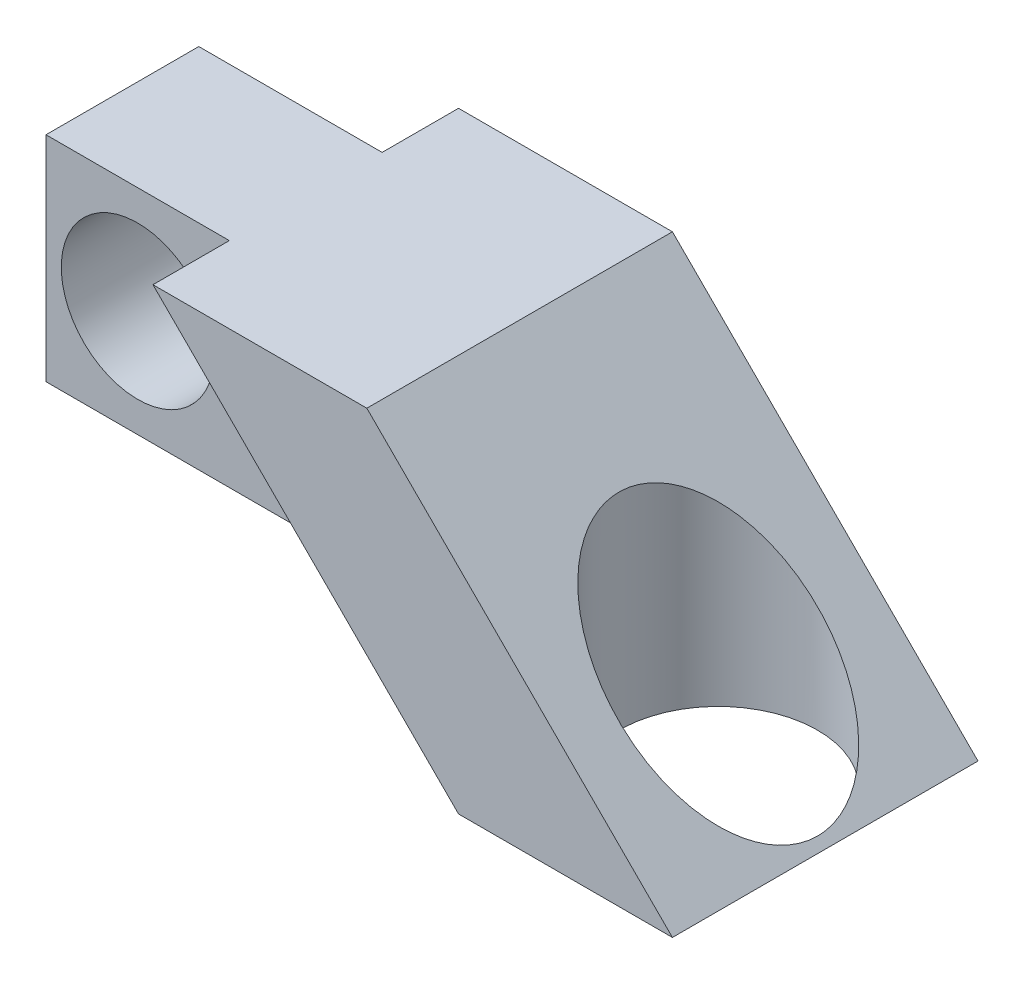
ISO-10303-21;
HEADER;
FILE_DESCRIPTION(('STEP AP214'),'2;1');
FILE_NAME('part.step','',(''),(''),'','','');
FILE_SCHEMA(('AUTOMOTIVE_DESIGN { 1 0 10303 214 1 1 1 1 }'));
ENDSEC;
DATA;
#1=APPLICATION_CONTEXT('core data for automotive mechanical design processes');
#2=APPLICATION_PROTOCOL_DEFINITION('international standard','automotive_design',2000,#1);
#3=PRODUCT_CONTEXT('',#1,'mechanical');
#4=PRODUCT('Part','Part','',(#3));
#5=PRODUCT_RELATED_PRODUCT_CATEGORY('part','',(#4));
#6=PRODUCT_DEFINITION_FORMATION('','',#4);
#7=PRODUCT_DEFINITION_CONTEXT('part definition',#1,'design');
#8=PRODUCT_DEFINITION('design','',#6,#7);
#9=PRODUCT_DEFINITION_SHAPE('','',#8);
#10=(LENGTH_UNIT() NAMED_UNIT(*) SI_UNIT(.MILLI.,.METRE.));
#11=(NAMED_UNIT(*) PLANE_ANGLE_UNIT() SI_UNIT($,.RADIAN.));
#12=(NAMED_UNIT(*) SI_UNIT($,.STERADIAN.) SOLID_ANGLE_UNIT());
#13=UNCERTAINTY_MEASURE_WITH_UNIT(LENGTH_MEASURE(1.E-05),#10,'distance_accuracy_value','');
#14=(GEOMETRIC_REPRESENTATION_CONTEXT(3) GLOBAL_UNCERTAINTY_ASSIGNED_CONTEXT((#13)) GLOBAL_UNIT_ASSIGNED_CONTEXT((#10,
#11,#12)) REPRESENTATION_CONTEXT('',''));
#15=CARTESIAN_POINT('',(0.,0.,0.));
#16=DIRECTION('',(0.,0.,1.));
#17=DIRECTION('',(1.,0.,0.));
#18=AXIS2_PLACEMENT_3D('',#15,#16,#17);
#19=CARTESIAN_POINT('',(0.,0.,5.));
#20=DIRECTION('',(-0.707106781186547,-0.707106781186548,0.));
#21=DIRECTION('',(0.707106781186548,-0.707106781186547,0.));
#22=AXIS2_PLACEMENT_3D('',#19,#20,#21);
#23=PLANE('',#22);
#24=CARTESIAN_POINT('',(-3.5,3.5,0.));
#25=DIRECTION('',(-0.707106781186547,-0.707106781186548,0.));
#26=DIRECTION('',(0.707106781186548,-0.707106781186547,0.));
#27=AXIS2_PLACEMENT_3D('',#24,#25,#26);
#28=ELLIPSE('',#27,4.59619407771256,3.25);
#29=CARTESIAN_POINT('',(-0.25,0.249999999999999,0.));
#30=VERTEX_POINT('',#29);
#31=EDGE_CURVE('E131',#30,#30,#28,.T.);
#32=ORIENTED_EDGE('',*,*,#31,.T.);
#33=EDGE_LOOP('',(#32));
#34=FACE_BOUND('',#33,.T.);
#35=DIRECTION('',(-0.707106781186548,0.707106781186547,0.));
#36=VECTOR('',#35,1.);
#37=CARTESIAN_POINT('',(0.,0.,-5.));
#38=LINE('',#37,#36);
#39=CARTESIAN_POINT('',(0.,0.,-5.));
#40=VERTEX_POINT('',#39);
#41=CARTESIAN_POINT('',(-10.,10.,-5.));
#42=VERTEX_POINT('',#41);
#43=EDGE_CURVE('E134',#40,#42,#38,.T.);
#44=ORIENTED_EDGE('',*,*,#43,.T.);
#45=DIRECTION('',(0.,0.,-1.));
#46=VECTOR('',#45,1.);
#47=CARTESIAN_POINT('',(-10.,10.,5.));
#48=LINE('',#47,#46);
#49=CARTESIAN_POINT('',(-10.,10.,5.));
#50=VERTEX_POINT('',#49);
#51=EDGE_CURVE('E162',#50,#42,#48,.T.);
#52=ORIENTED_EDGE('',*,*,#51,.F.);
#53=DIRECTION('',(-0.707106781186548,0.707106781186547,0.));
#54=VECTOR('',#53,1.);
#55=CARTESIAN_POINT('',(0.,0.,5.));
#56=LINE('',#55,#54);
#57=CARTESIAN_POINT('',(0.,0.,5.));
#58=VERTEX_POINT('',#57);
#59=EDGE_CURVE('E135',#58,#50,#56,.T.);
#60=ORIENTED_EDGE('',*,*,#59,.F.);
#61=DIRECTION('',(0.,0.,-1.));
#62=VECTOR('',#61,1.);
#63=CARTESIAN_POINT('',(0.,0.,5.));
#64=LINE('',#63,#62);
#65=EDGE_CURVE('E145',#58,#40,#64,.T.);
#66=ORIENTED_EDGE('',*,*,#65,.T.);
#67=EDGE_LOOP('',(#44,#52,#60,#66));
#68=FACE_BOUND('',#67,.T.);
#69=ADVANCED_FACE('F33',(#34,#68),#23,.F.);
#70=CARTESIAN_POINT('',(-10.,10.,5.));
#71=DIRECTION('',(0.,-1.,0.));
#72=DIRECTION('',(1.,0.,0.));
#73=AXIS2_PLACEMENT_3D('',#70,#71,#72);
#74=PLANE('',#73);
#75=ORIENTED_EDGE('',*,*,#51,.T.);
#76=DIRECTION('',(-1.,0.,0.));
#77=VECTOR('',#76,1.);
#78=CARTESIAN_POINT('',(-10.,10.,-5.));
#79=LINE('',#78,#77);
#80=CARTESIAN_POINT('',(-17.,10.,-5.));
#81=VERTEX_POINT('',#80);
#82=EDGE_CURVE('E148',#42,#81,#79,.T.);
#83=ORIENTED_EDGE('',*,*,#82,.T.);
#84=DIRECTION('',(0.,0.,-1.));
#85=VECTOR('',#84,1.);
#86=CARTESIAN_POINT('',(-17.,10.,5.));
#87=LINE('',#86,#85);
#88=CARTESIAN_POINT('',(-17.,10.,-2.5));
#89=VERTEX_POINT('',#88);
#90=EDGE_CURVE('E159',#89,#81,#87,.T.);
#91=ORIENTED_EDGE('',*,*,#90,.F.);
#92=DIRECTION('',(-1.,0.,0.));
#93=VECTOR('',#92,1.);
#94=CARTESIAN_POINT('',(-10.,10.,-2.5));
#95=LINE('',#94,#93);
#96=CARTESIAN_POINT('',(-23.,10.,-2.5));
#97=VERTEX_POINT('',#96);
#98=EDGE_CURVE('E107',#89,#97,#95,.T.);
#99=ORIENTED_EDGE('',*,*,#98,.T.);
#100=DIRECTION('',(0.,0.,-1.));
#101=VECTOR('',#100,1.);
#102=CARTESIAN_POINT('',(-23.,10.,2.5));
#103=LINE('',#102,#101);
#104=CARTESIAN_POINT('',(-23.,10.,2.5));
#105=VERTEX_POINT('',#104);
#106=EDGE_CURVE('E104',#105,#97,#103,.T.);
#107=ORIENTED_EDGE('',*,*,#106,.F.);
#108=DIRECTION('',(-1.,0.,0.));
#109=VECTOR('',#108,1.);
#110=CARTESIAN_POINT('',(-10.,10.,2.5));
#111=LINE('',#110,#109);
#112=CARTESIAN_POINT('',(-17.,10.,2.5));
#113=VERTEX_POINT('',#112);
#114=EDGE_CURVE('E93',#113,#105,#111,.T.);
#115=ORIENTED_EDGE('',*,*,#114,.F.);
#116=CARTESIAN_POINT('',(-17.,10.,5.));
#117=VERTEX_POINT('',#116);
#118=EDGE_CURVE('E160',#117,#113,#87,.T.);
#119=ORIENTED_EDGE('',*,*,#118,.F.);
#120=DIRECTION('',(-1.,0.,0.));
#121=VECTOR('',#120,1.);
#122=CARTESIAN_POINT('',(-10.,10.,5.));
#123=LINE('',#122,#121);
#124=EDGE_CURVE('E138',#50,#117,#123,.T.);
#125=ORIENTED_EDGE('',*,*,#124,.F.);
#126=EDGE_LOOP('',(#75,#83,#91,#99,#107,#115,#119,#125));
#127=FACE_BOUND('',#126,.T.);
#128=ADVANCED_FACE('F105',(#127),#74,.F.);
#129=CARTESIAN_POINT('',(-7.,0.,5.));
#130=DIRECTION('',(0.707106781186547,0.707106781186548,0.));
#131=DIRECTION('',(-0.707106781186548,0.707106781186547,0.));
#132=AXIS2_PLACEMENT_3D('',#129,#130,#131);
#133=PLANE('',#132);
#134=ORIENTED_EDGE('',*,*,#118,.T.);
#135=DIRECTION('',(0.707106781186548,-0.707106781186547,0.));
#136=VECTOR('',#135,1.);
#137=CARTESIAN_POINT('',(-7.,0.,2.5));
#138=LINE('',#137,#136);
#139=CARTESIAN_POINT('',(-10.,3.,2.5));
#140=VERTEX_POINT('',#139);
#141=EDGE_CURVE('E11',#113,#140,#138,.T.);
#142=ORIENTED_EDGE('',*,*,#141,.T.);
#143=DIRECTION('',(0.,0.,-1.));
#144=VECTOR('',#143,1.);
#145=CARTESIAN_POINT('',(-10.,3.,2.5));
#146=LINE('',#145,#144);
#147=CARTESIAN_POINT('',(-10.,3.,-2.5));
#148=VERTEX_POINT('',#147);
#149=EDGE_CURVE('E118',#140,#148,#146,.T.);
#150=ORIENTED_EDGE('',*,*,#149,.T.);
#151=DIRECTION('',(0.707106781186548,-0.707106781186547,0.));
#152=VECTOR('',#151,1.);
#153=CARTESIAN_POINT('',(-7.,0.,-2.5));
#154=LINE('',#153,#152);
#155=EDGE_CURVE('E41',#89,#148,#154,.T.);
#156=ORIENTED_EDGE('',*,*,#155,.F.);
#157=ORIENTED_EDGE('',*,*,#90,.T.);
#158=DIRECTION('',(0.707106781186548,-0.707106781186547,0.));
#159=VECTOR('',#158,1.);
#160=CARTESIAN_POINT('',(-7.,0.,-5.));
#161=LINE('',#160,#159);
#162=CARTESIAN_POINT('',(-7.,0.,-5.));
#163=VERTEX_POINT('',#162);
#164=EDGE_CURVE('E151',#81,#163,#161,.T.);
#165=ORIENTED_EDGE('',*,*,#164,.T.);
#166=DIRECTION('',(0.,0.,-1.));
#167=VECTOR('',#166,1.);
#168=CARTESIAN_POINT('',(-7.,0.,5.));
#169=LINE('',#168,#167);
#170=CARTESIAN_POINT('',(-7.,0.,5.));
#171=VERTEX_POINT('',#170);
#172=EDGE_CURVE('E156',#171,#163,#169,.T.);
#173=ORIENTED_EDGE('',*,*,#172,.F.);
#174=DIRECTION('',(0.707106781186548,-0.707106781186547,0.));
#175=VECTOR('',#174,1.);
#176=CARTESIAN_POINT('',(-7.,0.,5.));
#177=LINE('',#176,#175);
#178=EDGE_CURVE('E141',#117,#171,#177,.T.);
#179=ORIENTED_EDGE('',*,*,#178,.F.);
#180=EDGE_LOOP('',(#134,#142,#150,#156,#157,#165,#173,#179));
#181=FACE_BOUND('',#180,.T.);
#182=ADVANCED_FACE('F170',(#181),#133,.F.);
#183=CARTESIAN_POINT('',(0.,0.,5.));
#184=DIRECTION('',(0.,1.,0.));
#185=DIRECTION('',(-1.,0.,0.));
#186=AXIS2_PLACEMENT_3D('',#183,#184,#185);
#187=PLANE('',#186);
#188=CARTESIAN_POINT('',(-3.5,0.,0.));
#189=DIRECTION('',(0.,-1.,0.));
#190=DIRECTION('',(1.,0.,0.));
#191=AXIS2_PLACEMENT_3D('',#188,#189,#190);
#192=CIRCLE('',#191,3.25);
#193=CARTESIAN_POINT('',(-0.25,0.,0.));
#194=VERTEX_POINT('',#193);
#195=EDGE_CURVE('E110',#194,#194,#192,.T.);
#196=ORIENTED_EDGE('',*,*,#195,.F.);
#197=EDGE_LOOP('',(#196));
#198=FACE_BOUND('',#197,.T.);
#199=DIRECTION('',(1.,0.,0.));
#200=VECTOR('',#199,1.);
#201=CARTESIAN_POINT('',(0.,0.,-5.));
#202=LINE('',#201,#200);
#203=EDGE_CURVE('E139',#163,#40,#202,.T.);
#204=ORIENTED_EDGE('',*,*,#203,.T.);
#205=ORIENTED_EDGE('',*,*,#65,.F.);
#206=DIRECTION('',(1.,0.,0.));
#207=VECTOR('',#206,1.);
#208=CARTESIAN_POINT('',(0.,0.,5.));
#209=LINE('',#208,#207);
#210=EDGE_CURVE('E143',#171,#58,#209,.T.);
#211=ORIENTED_EDGE('',*,*,#210,.F.);
#212=ORIENTED_EDGE('',*,*,#172,.T.);
#213=EDGE_LOOP('',(#204,#205,#211,#212));
#214=FACE_BOUND('',#213,.T.);
#215=ADVANCED_FACE('F173',(#198,#214),#187,.F.);
#216=CARTESIAN_POINT('',(0.,0.,5.));
#217=DIRECTION('',(0.,0.,1.));
#218=DIRECTION('',(1.,0.,0.));
#219=AXIS2_PLACEMENT_3D('',#216,#217,#218);
#220=PLANE('',#219);
#221=ORIENTED_EDGE('',*,*,#59,.T.);
#222=ORIENTED_EDGE('',*,*,#124,.T.);
#223=ORIENTED_EDGE('',*,*,#178,.T.);
#224=ORIENTED_EDGE('',*,*,#210,.T.);
#225=EDGE_LOOP('',(#221,#222,#223,#224));
#226=FACE_BOUND('',#225,.T.);
#227=ADVANCED_FACE('F179',(#226),#220,.T.);
#228=CARTESIAN_POINT('',(0.,0.,-5.));
#229=DIRECTION('',(0.,0.,1.));
#230=DIRECTION('',(1.,0.,0.));
#231=AXIS2_PLACEMENT_3D('',#228,#229,#230);
#232=PLANE('',#231);
#233=ORIENTED_EDGE('',*,*,#43,.F.);
#234=ORIENTED_EDGE('',*,*,#203,.F.);
#235=ORIENTED_EDGE('',*,*,#164,.F.);
#236=ORIENTED_EDGE('',*,*,#82,.F.);
#237=EDGE_LOOP('',(#233,#234,#235,#236));
#238=FACE_BOUND('',#237,.T.);
#239=ADVANCED_FACE('F195',(#238),#232,.F.);
#240=CARTESIAN_POINT('',(-3.5,10.,0.));
#241=DIRECTION('',(0.,-1.,0.));
#242=DIRECTION('',(1.,0.,0.));
#243=AXIS2_PLACEMENT_3D('',#240,#241,#242);
#244=CYLINDRICAL_SURFACE('',#243,3.25);
#245=ORIENTED_EDGE('',*,*,#195,.T.);
#246=EDGE_LOOP('',(#245));
#247=FACE_BOUND('',#246,.T.);
#248=ORIENTED_EDGE('',*,*,#31,.F.);
#249=EDGE_LOOP('',(#248));
#250=FACE_BOUND('',#249,.T.);
#251=ADVANCED_FACE('F206',(#247,#250),#244,.F.);
#252=CARTESIAN_POINT('',(0.,0.,2.5));
#253=DIRECTION('',(0.,0.,1.));
#254=DIRECTION('',(1.,0.,0.));
#255=AXIS2_PLACEMENT_3D('',#252,#253,#254);
#256=PLANE('',#255);
#257=CARTESIAN_POINT('',(-20.,6.5,2.5));
#258=DIRECTION('',(0.,0.,1.));
#259=DIRECTION('',(1.,0.,0.));
#260=AXIS2_PLACEMENT_3D('',#257,#258,#259);
#261=CIRCLE('',#260,2.5);
#262=CARTESIAN_POINT('',(-17.5,6.5,2.5));
#263=VERTEX_POINT('',#262);
#264=EDGE_CURVE('E230',#263,#263,#261,.T.);
#265=ORIENTED_EDGE('',*,*,#264,.F.);
#266=EDGE_LOOP('',(#265));
#267=FACE_BOUND('',#266,.T.);
#268=ORIENTED_EDGE('',*,*,#141,.F.);
#269=ORIENTED_EDGE('',*,*,#114,.T.);
#270=DIRECTION('',(0.,-1.,0.));
#271=VECTOR('',#270,1.);
#272=CARTESIAN_POINT('',(-23.,3.,2.5));
#273=LINE('',#272,#271);
#274=CARTESIAN_POINT('',(-23.,3.,2.5));
#275=VERTEX_POINT('',#274);
#276=EDGE_CURVE('E97',#105,#275,#273,.T.);
#277=ORIENTED_EDGE('',*,*,#276,.T.);
#278=DIRECTION('',(1.,0.,0.));
#279=VECTOR('',#278,1.);
#280=CARTESIAN_POINT('',(-10.,3.,2.5));
#281=LINE('',#280,#279);
#282=EDGE_CURVE('E116',#275,#140,#281,.T.);
#283=ORIENTED_EDGE('',*,*,#282,.T.);
#284=EDGE_LOOP('',(#268,#269,#277,#283));
#285=FACE_BOUND('',#284,.T.);
#286=ADVANCED_FACE('F95',(#267,#285),#256,.T.);
#287=CARTESIAN_POINT('',(0.,0.,-2.5));
#288=DIRECTION('',(0.,0.,1.));
#289=DIRECTION('',(1.,0.,0.));
#290=AXIS2_PLACEMENT_3D('',#287,#288,#289);
#291=PLANE('',#290);
#292=CARTESIAN_POINT('',(-20.,6.5,-2.5));
#293=DIRECTION('',(0.,0.,1.));
#294=DIRECTION('',(1.,0.,0.));
#295=AXIS2_PLACEMENT_3D('',#292,#293,#294);
#296=CIRCLE('',#295,2.5);
#297=CARTESIAN_POINT('',(-17.5,6.5,-2.5));
#298=VERTEX_POINT('',#297);
#299=EDGE_CURVE('E36',#298,#298,#296,.T.);
#300=ORIENTED_EDGE('',*,*,#299,.T.);
#301=EDGE_LOOP('',(#300));
#302=FACE_BOUND('',#301,.T.);
#303=ORIENTED_EDGE('',*,*,#98,.F.);
#304=ORIENTED_EDGE('',*,*,#155,.T.);
#305=DIRECTION('',(1.,0.,0.));
#306=VECTOR('',#305,1.);
#307=CARTESIAN_POINT('',(-10.,3.,-2.5));
#308=LINE('',#307,#306);
#309=CARTESIAN_POINT('',(-23.,3.,-2.5));
#310=VERTEX_POINT('',#309);
#311=EDGE_CURVE('E101',#310,#148,#308,.T.);
#312=ORIENTED_EDGE('',*,*,#311,.F.);
#313=DIRECTION('',(0.,-1.,0.));
#314=VECTOR('',#313,1.);
#315=CARTESIAN_POINT('',(-23.,3.,-2.5));
#316=LINE('',#315,#314);
#317=EDGE_CURVE('E123',#97,#310,#316,.T.);
#318=ORIENTED_EDGE('',*,*,#317,.F.);
#319=EDGE_LOOP('',(#303,#304,#312,#318));
#320=FACE_BOUND('',#319,.T.);
#321=ADVANCED_FACE('F166',(#302,#320),#291,.F.);
#322=CARTESIAN_POINT('',(-23.,3.,2.5));
#323=DIRECTION('',(1.,0.,0.));
#324=DIRECTION('',(0.,0.,-1.));
#325=AXIS2_PLACEMENT_3D('',#322,#323,#324);
#326=PLANE('',#325);
#327=ORIENTED_EDGE('',*,*,#317,.T.);
#328=DIRECTION('',(0.,0.,-1.));
#329=VECTOR('',#328,1.);
#330=CARTESIAN_POINT('',(-23.,3.,2.5));
#331=LINE('',#330,#329);
#332=EDGE_CURVE('E111',#275,#310,#331,.T.);
#333=ORIENTED_EDGE('',*,*,#332,.F.);
#334=ORIENTED_EDGE('',*,*,#276,.F.);
#335=ORIENTED_EDGE('',*,*,#106,.T.);
#336=EDGE_LOOP('',(#327,#333,#334,#335));
#337=FACE_BOUND('',#336,.T.);
#338=ADVANCED_FACE('F113',(#337),#326,.F.);
#339=CARTESIAN_POINT('',(-10.,3.,2.5));
#340=DIRECTION('',(0.,1.,0.));
#341=DIRECTION('',(-1.,0.,0.));
#342=AXIS2_PLACEMENT_3D('',#339,#340,#341);
#343=PLANE('',#342);
#344=ORIENTED_EDGE('',*,*,#311,.T.);
#345=ORIENTED_EDGE('',*,*,#149,.F.);
#346=ORIENTED_EDGE('',*,*,#282,.F.);
#347=ORIENTED_EDGE('',*,*,#332,.T.);
#348=EDGE_LOOP('',(#344,#345,#346,#347));
#349=FACE_BOUND('',#348,.T.);
#350=ADVANCED_FACE('F169',(#349),#343,.F.);
#351=CARTESIAN_POINT('',(-20.,6.5,-5.));
#352=DIRECTION('',(0.,0.,1.));
#353=DIRECTION('',(1.,0.,0.));
#354=AXIS2_PLACEMENT_3D('',#351,#352,#353);
#355=CYLINDRICAL_SURFACE('',#354,2.5);
#356=ORIENTED_EDGE('',*,*,#264,.T.);
#357=EDGE_LOOP('',(#356));
#358=FACE_BOUND('',#357,.T.);
#359=ORIENTED_EDGE('',*,*,#299,.F.);
#360=EDGE_LOOP('',(#359));
#361=FACE_BOUND('',#360,.T.);
#362=ADVANCED_FACE('F216',(#358,#361),#355,.F.);
#363=CLOSED_SHELL('',(#69,#128,#182,#215,#227,#239,#251,#286,#321,#338,#350,#362));
#364=MANIFOLD_SOLID_BREP('B2',#363);
#365=ADVANCED_BREP_SHAPE_REPRESENTATION('',(#18,#364),#14);
#366=SHAPE_DEFINITION_REPRESENTATION(#9,#365);
ENDSEC;
END-ISO-10303-21;
